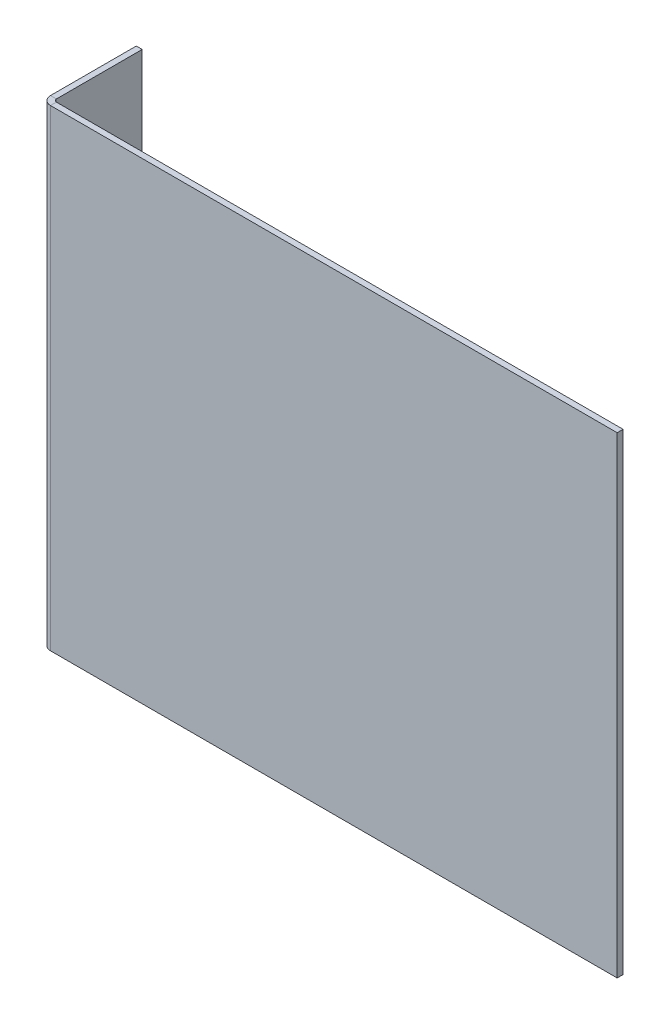
ISO-10303-21;
HEADER;
FILE_DESCRIPTION(('STEP AP214'),'2;1');
FILE_NAME('part.step','',(''),(''),'','','');
FILE_SCHEMA(('AUTOMOTIVE_DESIGN { 1 0 10303 214 1 1 1 1 }'));
ENDSEC;
DATA;
#1=APPLICATION_CONTEXT('core data for automotive mechanical design processes');
#2=APPLICATION_PROTOCOL_DEFINITION('international standard','automotive_design',2000,#1);
#3=PRODUCT_CONTEXT('',#1,'mechanical');
#4=PRODUCT('Part','Part','',(#3));
#5=PRODUCT_RELATED_PRODUCT_CATEGORY('part','',(#4));
#6=PRODUCT_DEFINITION_FORMATION('','',#4);
#7=PRODUCT_DEFINITION_CONTEXT('part definition',#1,'design');
#8=PRODUCT_DEFINITION('design','',#6,#7);
#9=PRODUCT_DEFINITION_SHAPE('','',#8);
#10=(LENGTH_UNIT() NAMED_UNIT(*) SI_UNIT(.MILLI.,.METRE.));
#11=(NAMED_UNIT(*) PLANE_ANGLE_UNIT() SI_UNIT($,.RADIAN.));
#12=(NAMED_UNIT(*) SI_UNIT($,.STERADIAN.) SOLID_ANGLE_UNIT());
#13=UNCERTAINTY_MEASURE_WITH_UNIT(LENGTH_MEASURE(1.E-05),#10,'distance_accuracy_value','');
#14=(GEOMETRIC_REPRESENTATION_CONTEXT(3) GLOBAL_UNCERTAINTY_ASSIGNED_CONTEXT((#13)) GLOBAL_UNIT_ASSIGNED_CONTEXT((#10,
#11,#12)) REPRESENTATION_CONTEXT('',''));
#15=CARTESIAN_POINT('',(0.,0.,0.));
#16=DIRECTION('',(0.,0.,1.));
#17=DIRECTION('',(1.,0.,0.));
#18=AXIS2_PLACEMENT_3D('',#15,#16,#17);
#19=CARTESIAN_POINT('',(76.2,63.5,-1.5875));
#20=DIRECTION('',(1.,0.,0.));
#21=DIRECTION('',(0.,0.,-1.));
#22=AXIS2_PLACEMENT_3D('',#19,#20,#21);
#23=PLANE('',#22);
#24=DIRECTION('',(0.,1.,0.));
#25=VECTOR('',#24,1.);
#26=CARTESIAN_POINT('',(76.2,63.5,0.));
#27=LINE('',#26,#25);
#28=CARTESIAN_POINT('',(76.2,-63.5,0.));
#29=VERTEX_POINT('',#28);
#30=CARTESIAN_POINT('',(76.2,63.5,0.));
#31=VERTEX_POINT('',#30);
#32=EDGE_CURVE('E102',#29,#31,#27,.T.);
#33=ORIENTED_EDGE('',*,*,#32,.F.);
#34=DIRECTION('',(0.,0.,1.));
#35=VECTOR('',#34,1.);
#36=CARTESIAN_POINT('',(76.2,-63.5,-1.5875));
#37=LINE('',#36,#35);
#38=CARTESIAN_POINT('',(76.2,-63.5,-1.5875));
#39=VERTEX_POINT('',#38);
#40=EDGE_CURVE('E13',#39,#29,#37,.T.);
#41=ORIENTED_EDGE('',*,*,#40,.F.);
#42=DIRECTION('',(0.,1.,0.));
#43=VECTOR('',#42,1.);
#44=CARTESIAN_POINT('',(76.2,63.5,-1.5875));
#45=LINE('',#44,#43);
#46=CARTESIAN_POINT('',(76.2,63.5,-1.5875));
#47=VERTEX_POINT('',#46);
#48=EDGE_CURVE('E111',#39,#47,#45,.T.);
#49=ORIENTED_EDGE('',*,*,#48,.T.);
#50=DIRECTION('',(0.,0.,1.));
#51=VECTOR('',#50,1.);
#52=CARTESIAN_POINT('',(76.2,63.5,-1.5875));
#53=LINE('',#52,#51);
#54=EDGE_CURVE('E62',#47,#31,#53,.T.);
#55=ORIENTED_EDGE('',*,*,#54,.T.);
#56=EDGE_LOOP('',(#33,#41,#49,#55));
#57=FACE_BOUND('',#56,.T.);
#58=ADVANCED_FACE('F59',(#57),#23,.T.);
#59=CARTESIAN_POINT('',(-76.2,-63.5,-1.5875));
#60=DIRECTION('',(0.,-1.,0.));
#61=DIRECTION('',(0.,0.,-1.));
#62=AXIS2_PLACEMENT_3D('',#59,#60,#61);
#63=PLANE('',#62);
#64=DIRECTION('',(1.,0.,0.));
#65=VECTOR('',#64,1.);
#66=CARTESIAN_POINT('',(-76.2,-63.5,0.));
#67=LINE('',#66,#65);
#68=CARTESIAN_POINT('',(-76.2,-63.5,0.));
#69=VERTEX_POINT('',#68);
#70=EDGE_CURVE('E98',#69,#29,#67,.T.);
#71=ORIENTED_EDGE('',*,*,#70,.F.);
#72=DIRECTION('',(0.,0.,1.));
#73=VECTOR('',#72,1.);
#74=CARTESIAN_POINT('',(-76.2,-63.5,-1.5875));
#75=LINE('',#74,#73);
#76=CARTESIAN_POINT('',(-76.2,-63.5,-1.58749999999999));
#77=VERTEX_POINT('',#76);
#78=EDGE_CURVE('E68',#77,#69,#75,.T.);
#79=ORIENTED_EDGE('',*,*,#78,.F.);
#80=DIRECTION('',(1.,0.,0.));
#81=VECTOR('',#80,1.);
#82=CARTESIAN_POINT('',(-76.2,-63.5,-1.5875));
#83=LINE('',#82,#81);
#84=EDGE_CURVE('E100',#77,#39,#83,.T.);
#85=ORIENTED_EDGE('',*,*,#84,.T.);
#86=ORIENTED_EDGE('',*,*,#40,.T.);
#87=EDGE_LOOP('',(#71,#79,#85,#86));
#88=FACE_BOUND('',#87,.T.);
#89=ADVANCED_FACE('F95',(#88),#63,.T.);
#90=CARTESIAN_POINT('',(-76.2,63.5,-1.5875));
#91=DIRECTION('',(0.,1.,0.));
#92=DIRECTION('',(0.,0.,1.));
#93=AXIS2_PLACEMENT_3D('',#90,#91,#92);
#94=PLANE('',#93);
#95=DIRECTION('',(-1.,0.,0.));
#96=VECTOR('',#95,1.);
#97=CARTESIAN_POINT('',(-76.2,63.5,0.));
#98=LINE('',#97,#96);
#99=CARTESIAN_POINT('',(-76.2,63.5,0.));
#100=VERTEX_POINT('',#99);
#101=EDGE_CURVE('E106',#31,#100,#98,.T.);
#102=ORIENTED_EDGE('',*,*,#101,.F.);
#103=ORIENTED_EDGE('',*,*,#54,.F.);
#104=DIRECTION('',(-1.,0.,0.));
#105=VECTOR('',#104,1.);
#106=CARTESIAN_POINT('',(-76.2,63.5,-1.5875));
#107=LINE('',#106,#105);
#108=CARTESIAN_POINT('',(-76.2,63.5,-1.58749999999999));
#109=VERTEX_POINT('',#108);
#110=EDGE_CURVE('E113',#47,#109,#107,.T.);
#111=ORIENTED_EDGE('',*,*,#110,.T.);
#112=DIRECTION('',(0.,0.,1.));
#113=VECTOR('',#112,1.);
#114=CARTESIAN_POINT('',(-76.2,63.5,-1.5875));
#115=LINE('',#114,#113);
#116=EDGE_CURVE('E118',#109,#100,#115,.T.);
#117=ORIENTED_EDGE('',*,*,#116,.T.);
#118=EDGE_LOOP('',(#102,#103,#111,#117));
#119=FACE_BOUND('',#118,.T.);
#120=ADVANCED_FACE('F130',(#119),#94,.T.);
#121=CARTESIAN_POINT('',(0.,0.,-1.5875));
#122=DIRECTION('',(0.,0.,1.));
#123=DIRECTION('',(1.,0.,0.));
#124=AXIS2_PLACEMENT_3D('',#121,#122,#123);
#125=PLANE('',#124);
#126=ORIENTED_EDGE('',*,*,#48,.F.);
#127=ORIENTED_EDGE('',*,*,#84,.F.);
#128=DIRECTION('',(0.,-1.,0.));
#129=VECTOR('',#128,1.);
#130=CARTESIAN_POINT('',(-76.2,63.5,-1.5875));
#131=LINE('',#130,#129);
#132=EDGE_CURVE('E123',#109,#77,#131,.T.);
#133=ORIENTED_EDGE('',*,*,#132,.F.);
#134=ORIENTED_EDGE('',*,*,#110,.F.);
#135=EDGE_LOOP('',(#126,#127,#133,#134));
#136=FACE_BOUND('',#135,.T.);
#137=ADVANCED_FACE('F135',(#136),#125,.F.);
#138=CARTESIAN_POINT('',(0.,0.,0.));
#139=DIRECTION('',(0.,0.,1.));
#140=DIRECTION('',(1.,0.,0.));
#141=AXIS2_PLACEMENT_3D('',#138,#139,#140);
#142=PLANE('',#141);
#143=ORIENTED_EDGE('',*,*,#32,.T.);
#144=ORIENTED_EDGE('',*,*,#101,.T.);
#145=DIRECTION('',(0.,-1.,0.));
#146=VECTOR('',#145,1.);
#147=CARTESIAN_POINT('',(-76.2,63.5,0.));
#148=LINE('',#147,#146);
#149=EDGE_CURVE('E110',#100,#69,#148,.T.);
#150=ORIENTED_EDGE('',*,*,#149,.T.);
#151=ORIENTED_EDGE('',*,*,#70,.T.);
#152=EDGE_LOOP('',(#143,#144,#150,#151));
#153=FACE_BOUND('',#152,.T.);
#154=ADVANCED_FACE('F109',(#153),#142,.T.);
#155=CARTESIAN_POINT('',(-76.2,-63.5,-2.32410000000001));
#156=DIRECTION('',(0.,-1.,0.));
#157=DIRECTION('',(0.,0.,-1.));
#158=AXIS2_PLACEMENT_3D('',#155,#156,#157);
#159=PLANE('',#158);
#160=DIRECTION('',(-1.,0.,0.));
#161=VECTOR('',#160,1.);
#162=CARTESIAN_POINT('',(-78.5241,-63.5,-2.3241));
#163=LINE('',#162,#161);
#164=CARTESIAN_POINT('',(-76.9366000000001,-63.5,-2.32410000000001));
#165=VERTEX_POINT('',#164);
#166=CARTESIAN_POINT('',(-78.5241000000001,-63.5,-2.3241));
#167=VERTEX_POINT('',#166);
#168=EDGE_CURVE('E148',#165,#167,#163,.T.);
#169=ORIENTED_EDGE('',*,*,#168,.F.);
#170=CARTESIAN_POINT('',(-76.2,-63.5,-2.32410000000001));
#171=DIRECTION('',(0.,1.,0.));
#172=DIRECTION('',(0.,0.,1.));
#173=AXIS2_PLACEMENT_3D('',#170,#171,#172);
#174=CIRCLE('',#173,0.736600000000018);
#175=EDGE_CURVE('E140',#77,#165,#174,.F.);
#176=ORIENTED_EDGE('',*,*,#175,.F.);
#177=ORIENTED_EDGE('',*,*,#78,.T.);
#178=CARTESIAN_POINT('',(-76.2,-63.5,-2.32410000000001));
#179=DIRECTION('',(0.,1.,0.));
#180=DIRECTION('',(0.,0.,1.));
#181=AXIS2_PLACEMENT_3D('',#178,#179,#180);
#182=CIRCLE('',#181,2.32410000000002);
#183=EDGE_CURVE('E90',#69,#167,#182,.F.);
#184=ORIENTED_EDGE('',*,*,#183,.T.);
#185=EDGE_LOOP('',(#169,#176,#177,#184));
#186=FACE_BOUND('',#185,.T.);
#187=ADVANCED_FACE('F218',(#186),#159,.T.);
#188=CARTESIAN_POINT('',(-76.2,63.5,-2.32410000000001));
#189=DIRECTION('',(0.,-1.,0.));
#190=DIRECTION('',(0.,0.,-1.));
#191=AXIS2_PLACEMENT_3D('',#188,#189,#190);
#192=PLANE('',#191);
#193=CARTESIAN_POINT('',(-76.2,63.5,-2.32410000000001));
#194=DIRECTION('',(0.,1.,0.));
#195=DIRECTION('',(0.,0.,1.));
#196=AXIS2_PLACEMENT_3D('',#193,#194,#195);
#197=CIRCLE('',#196,0.736600000000018);
#198=CARTESIAN_POINT('',(-76.9366000000001,63.5,-2.32410000000001));
#199=VERTEX_POINT('',#198);
#200=EDGE_CURVE('E137',#199,#109,#197,.T.);
#201=ORIENTED_EDGE('',*,*,#200,.F.);
#202=DIRECTION('',(-1.,0.,0.));
#203=VECTOR('',#202,1.);
#204=CARTESIAN_POINT('',(-76.9366000000001,63.5,-2.32410000000001));
#205=LINE('',#204,#203);
#206=CARTESIAN_POINT('',(-78.5241,63.5,-2.3241));
#207=VERTEX_POINT('',#206);
#208=EDGE_CURVE('E154',#199,#207,#205,.T.);
#209=ORIENTED_EDGE('',*,*,#208,.T.);
#210=CARTESIAN_POINT('',(-76.2,63.5,-2.32410000000001));
#211=DIRECTION('',(0.,1.,0.));
#212=DIRECTION('',(0.,0.,1.));
#213=AXIS2_PLACEMENT_3D('',#210,#211,#212);
#214=CIRCLE('',#213,2.32410000000002);
#215=EDGE_CURVE('E144',#207,#100,#214,.T.);
#216=ORIENTED_EDGE('',*,*,#215,.T.);
#217=ORIENTED_EDGE('',*,*,#116,.F.);
#218=EDGE_LOOP('',(#201,#209,#216,#217));
#219=FACE_BOUND('',#218,.T.);
#220=ADVANCED_FACE('F207',(#219),#192,.F.);
#221=CARTESIAN_POINT('',(-76.2,63.5,-2.32410000000001));
#222=DIRECTION('',(0.,1.,0.));
#223=DIRECTION('',(-1.,0.,0.));
#224=AXIS2_PLACEMENT_3D('',#221,#222,#223);
#225=CYLINDRICAL_SURFACE('',#224,2.32410000000002);
#226=ORIENTED_EDGE('',*,*,#149,.F.);
#227=ORIENTED_EDGE('',*,*,#215,.F.);
#228=DIRECTION('',(0.,1.,0.));
#229=VECTOR('',#228,1.);
#230=CARTESIAN_POINT('',(-78.5241000000001,0.,-2.3241));
#231=LINE('',#230,#229);
#232=EDGE_CURVE('E157',#167,#207,#231,.T.);
#233=ORIENTED_EDGE('',*,*,#232,.F.);
#234=ORIENTED_EDGE('',*,*,#183,.F.);
#235=EDGE_LOOP('',(#226,#227,#233,#234));
#236=FACE_BOUND('',#235,.T.);
#237=ADVANCED_FACE('F213',(#236),#225,.T.);
#238=CARTESIAN_POINT('',(-76.2,63.5,-2.32410000000001));
#239=DIRECTION('',(0.,1.,0.));
#240=DIRECTION('',(-1.,0.,0.));
#241=AXIS2_PLACEMENT_3D('',#238,#239,#240);
#242=CYLINDRICAL_SURFACE('',#241,0.736600000000018);
#243=ORIENTED_EDGE('',*,*,#132,.T.);
#244=ORIENTED_EDGE('',*,*,#175,.T.);
#245=DIRECTION('',(0.,-1.,0.));
#246=VECTOR('',#245,1.);
#247=CARTESIAN_POINT('',(-76.9366000000001,-63.5,-2.32410000000001));
#248=LINE('',#247,#246);
#249=EDGE_CURVE('E151',#165,#199,#248,.F.);
#250=ORIENTED_EDGE('',*,*,#249,.T.);
#251=ORIENTED_EDGE('',*,*,#200,.T.);
#252=EDGE_LOOP('',(#243,#244,#250,#251));
#253=FACE_BOUND('',#252,.T.);
#254=ADVANCED_FACE('F229',(#253),#242,.F.);
#255=CARTESIAN_POINT('',(-78.5241,63.5,-1.58749999999999));
#256=DIRECTION('',(0.,1.,0.));
#257=DIRECTION('',(0.,0.,1.));
#258=AXIS2_PLACEMENT_3D('',#255,#256,#257);
#259=PLANE('',#258);
#260=DIRECTION('',(0.,0.,1.));
#261=VECTOR('',#260,1.);
#262=CARTESIAN_POINT('',(-78.5241,63.5,-1.58749999999999));
#263=LINE('',#262,#261);
#264=CARTESIAN_POINT('',(-78.5241000000001,63.5,-25.4));
#265=VERTEX_POINT('',#264);
#266=EDGE_CURVE('E175',#265,#207,#263,.T.);
#267=ORIENTED_EDGE('',*,*,#266,.T.);
#268=ORIENTED_EDGE('',*,*,#208,.F.);
#269=DIRECTION('',(0.,0.,-1.));
#270=VECTOR('',#269,1.);
#271=CARTESIAN_POINT('',(-76.9366,63.5,2.66453525910038E-13));
#272=LINE('',#271,#270);
#273=CARTESIAN_POINT('',(-76.9366000000001,63.5,-25.4));
#274=VERTEX_POINT('',#273);
#275=EDGE_CURVE('E166',#274,#199,#272,.F.);
#276=ORIENTED_EDGE('',*,*,#275,.F.);
#277=DIRECTION('',(1.,0.,0.));
#278=VECTOR('',#277,1.);
#279=CARTESIAN_POINT('',(-78.5241000000001,63.5,-25.4));
#280=LINE('',#279,#278);
#281=EDGE_CURVE('E141',#265,#274,#280,.T.);
#282=ORIENTED_EDGE('',*,*,#281,.F.);
#283=EDGE_LOOP('',(#267,#268,#276,#282));
#284=FACE_BOUND('',#283,.T.);
#285=ADVANCED_FACE('F202',(#284),#259,.T.);
#286=CARTESIAN_POINT('',(-78.5241000000001,-63.5,-25.4));
#287=DIRECTION('',(0.,-1.,0.));
#288=DIRECTION('',(0.,0.,-1.));
#289=AXIS2_PLACEMENT_3D('',#286,#287,#288);
#290=PLANE('',#289);
#291=DIRECTION('',(0.,0.,1.));
#292=VECTOR('',#291,1.);
#293=CARTESIAN_POINT('',(-76.9366,-63.5,2.66453525910038E-13));
#294=LINE('',#293,#292);
#295=CARTESIAN_POINT('',(-76.9366000000001,-63.5,-25.4));
#296=VERTEX_POINT('',#295);
#297=EDGE_CURVE('E160',#165,#296,#294,.F.);
#298=ORIENTED_EDGE('',*,*,#297,.F.);
#299=ORIENTED_EDGE('',*,*,#168,.T.);
#300=DIRECTION('',(0.,0.,-1.));
#301=VECTOR('',#300,1.);
#302=CARTESIAN_POINT('',(-78.5241000000001,-63.5,-25.4));
#303=LINE('',#302,#301);
#304=CARTESIAN_POINT('',(-78.5241000000001,-63.5,-25.4));
#305=VERTEX_POINT('',#304);
#306=EDGE_CURVE('E169',#167,#305,#303,.T.);
#307=ORIENTED_EDGE('',*,*,#306,.T.);
#308=DIRECTION('',(1.,0.,0.));
#309=VECTOR('',#308,1.);
#310=CARTESIAN_POINT('',(-78.5241000000001,-63.5,-25.4));
#311=LINE('',#310,#309);
#312=EDGE_CURVE('E178',#305,#296,#311,.T.);
#313=ORIENTED_EDGE('',*,*,#312,.T.);
#314=EDGE_LOOP('',(#298,#299,#307,#313));
#315=FACE_BOUND('',#314,.T.);
#316=ADVANCED_FACE('F221',(#315),#290,.T.);
#317=CARTESIAN_POINT('',(-78.5241,0.,2.71996252535451E-13));
#318=DIRECTION('',(-1.,0.,0.));
#319=DIRECTION('',(0.,0.,1.));
#320=AXIS2_PLACEMENT_3D('',#317,#318,#319);
#321=PLANE('',#320);
#322=ORIENTED_EDGE('',*,*,#306,.F.);
#323=ORIENTED_EDGE('',*,*,#232,.T.);
#324=ORIENTED_EDGE('',*,*,#266,.F.);
#325=DIRECTION('',(0.,1.,0.));
#326=VECTOR('',#325,1.);
#327=CARTESIAN_POINT('',(-78.5241000000001,63.5,-25.4));
#328=LINE('',#327,#326);
#329=EDGE_CURVE('E172',#305,#265,#328,.T.);
#330=ORIENTED_EDGE('',*,*,#329,.F.);
#331=EDGE_LOOP('',(#322,#323,#324,#330));
#332=FACE_BOUND('',#331,.T.);
#333=ADVANCED_FACE('F212',(#332),#321,.T.);
#334=CARTESIAN_POINT('',(-76.9366,0.,2.66453525910038E-13));
#335=DIRECTION('',(-1.,0.,0.));
#336=DIRECTION('',(0.,0.,1.));
#337=AXIS2_PLACEMENT_3D('',#334,#335,#336);
#338=PLANE('',#337);
#339=ORIENTED_EDGE('',*,*,#249,.F.);
#340=ORIENTED_EDGE('',*,*,#297,.T.);
#341=DIRECTION('',(0.,-1.,0.));
#342=VECTOR('',#341,1.);
#343=CARTESIAN_POINT('',(-76.9366000000001,0.,-25.4));
#344=LINE('',#343,#342);
#345=EDGE_CURVE('E163',#296,#274,#344,.F.);
#346=ORIENTED_EDGE('',*,*,#345,.T.);
#347=ORIENTED_EDGE('',*,*,#275,.T.);
#348=EDGE_LOOP('',(#339,#340,#346,#347));
#349=FACE_BOUND('',#348,.T.);
#350=ADVANCED_FACE('F198',(#349),#338,.F.);
#351=CARTESIAN_POINT('',(-78.5241000000001,63.5,-25.4));
#352=DIRECTION('',(0.,0.,-1.));
#353=DIRECTION('',(-1.,0.,0.));
#354=AXIS2_PLACEMENT_3D('',#351,#352,#353);
#355=PLANE('',#354);
#356=ORIENTED_EDGE('',*,*,#345,.F.);
#357=ORIENTED_EDGE('',*,*,#312,.F.);
#358=ORIENTED_EDGE('',*,*,#329,.T.);
#359=ORIENTED_EDGE('',*,*,#281,.T.);
#360=EDGE_LOOP('',(#356,#357,#358,#359));
#361=FACE_BOUND('',#360,.T.);
#362=ADVANCED_FACE('F186',(#361),#355,.T.);
#363=CLOSED_SHELL('',(#58,#89,#120,#137,#154,#187,#220,#237,#254,#285,#316,#333,#350,#362));
#364=MANIFOLD_SOLID_BREP('B2',#363);
#365=ADVANCED_BREP_SHAPE_REPRESENTATION('',(#18,#364),#14);
#366=SHAPE_DEFINITION_REPRESENTATION(#9,#365);
ENDSEC;
END-ISO-10303-21;
